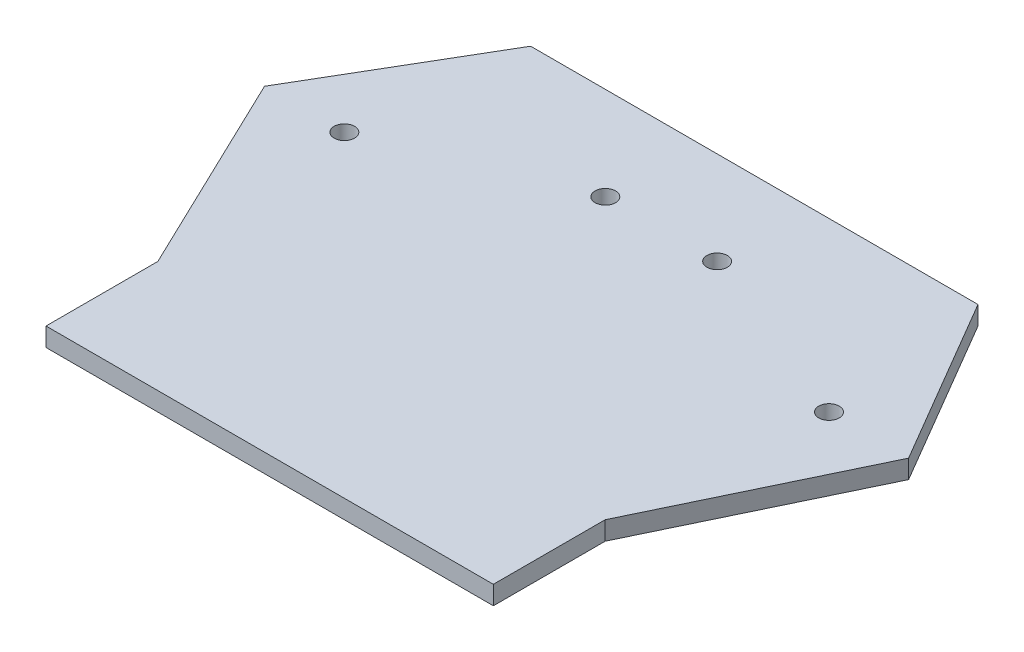
ISO-10303-21;
HEADER;
FILE_DESCRIPTION(('STEP AP214'),'2;1');
FILE_NAME('part.step','',(''),(''),'','','');
FILE_SCHEMA(('AUTOMOTIVE_DESIGN { 1 0 10303 214 1 1 1 1 }'));
ENDSEC;
DATA;
#1=APPLICATION_CONTEXT('core data for automotive mechanical design processes');
#2=APPLICATION_PROTOCOL_DEFINITION('international standard','automotive_design',2000,#1);
#3=PRODUCT_CONTEXT('',#1,'mechanical');
#4=PRODUCT('Part','Part','',(#3));
#5=PRODUCT_RELATED_PRODUCT_CATEGORY('part','',(#4));
#6=PRODUCT_DEFINITION_FORMATION('','',#4);
#7=PRODUCT_DEFINITION_CONTEXT('part definition',#1,'design');
#8=PRODUCT_DEFINITION('design','',#6,#7);
#9=PRODUCT_DEFINITION_SHAPE('','',#8);
#10=(LENGTH_UNIT() NAMED_UNIT(*) SI_UNIT(.MILLI.,.METRE.));
#11=(NAMED_UNIT(*) PLANE_ANGLE_UNIT() SI_UNIT($,.RADIAN.));
#12=(NAMED_UNIT(*) SI_UNIT($,.STERADIAN.) SOLID_ANGLE_UNIT());
#13=UNCERTAINTY_MEASURE_WITH_UNIT(LENGTH_MEASURE(1.E-05),#10,'distance_accuracy_value','');
#14=(GEOMETRIC_REPRESENTATION_CONTEXT(3) GLOBAL_UNCERTAINTY_ASSIGNED_CONTEXT((#13)) GLOBAL_UNIT_ASSIGNED_CONTEXT((#10,
#11,#12)) REPRESENTATION_CONTEXT('',''));
#15=CARTESIAN_POINT('',(0.,0.,0.));
#16=DIRECTION('',(0.,0.,1.));
#17=DIRECTION('',(1.,0.,0.));
#18=AXIS2_PLACEMENT_3D('',#15,#16,#17);
#19=CARTESIAN_POINT('',(-37.086877056062,5.,17.7911335719755));
#20=DIRECTION('',(0.901623256546711,0.,-0.432522257524515));
#21=DIRECTION('',(-0.432522257524515,0.,-0.901623256546711));
#22=AXIS2_PLACEMENT_3D('',#19,#20,#21);
#23=PLANE('',#22);
#24=DIRECTION('',(0.432522257524515,0.,0.901623256546711));
#25=VECTOR('',#24,1.);
#26=CARTESIAN_POINT('',(-37.086877056062,0.,17.7911335719755));
#27=LINE('',#26,#25);
#28=CARTESIAN_POINT('',(-86.3843284776848,0.,-84.972892826591));
#29=VERTEX_POINT('',#28);
#30=CARTESIAN_POINT('',(-60.,0.,-29.972892826591));
#31=VERTEX_POINT('',#30);
#32=EDGE_CURVE('E146',#29,#31,#27,.T.);
#33=ORIENTED_EDGE('',*,*,#32,.T.);
#34=DIRECTION('',(0.,-1.,0.));
#35=VECTOR('',#34,1.);
#36=CARTESIAN_POINT('',(-60.,5.,-29.972892826591));
#37=LINE('',#36,#35);
#38=CARTESIAN_POINT('',(-60.,5.,-29.972892826591));
#39=VERTEX_POINT('',#38);
#40=EDGE_CURVE('E11',#39,#31,#37,.T.);
#41=ORIENTED_EDGE('',*,*,#40,.F.);
#42=DIRECTION('',(0.432522257524515,0.,0.901623256546711));
#43=VECTOR('',#42,1.);
#44=CARTESIAN_POINT('',(-37.086877056062,5.,17.7911335719755));
#45=LINE('',#44,#43);
#46=CARTESIAN_POINT('',(-86.3843284776848,5.,-84.972892826591));
#47=VERTEX_POINT('',#46);
#48=EDGE_CURVE('E198',#47,#39,#45,.T.);
#49=ORIENTED_EDGE('',*,*,#48,.F.);
#50=DIRECTION('',(0.,-1.,0.));
#51=VECTOR('',#50,1.);
#52=CARTESIAN_POINT('',(-86.3843284776848,5.,-84.972892826591));
#53=LINE('',#52,#51);
#54=EDGE_CURVE('E52',#47,#29,#53,.T.);
#55=ORIENTED_EDGE('',*,*,#54,.T.);
#56=EDGE_LOOP('',(#33,#41,#49,#55));
#57=FACE_BOUND('',#56,.T.);
#58=ADVANCED_FACE('F35',(#57),#23,.F.);
#59=CARTESIAN_POINT('',(-60.,5.,0.));
#60=DIRECTION('',(1.,0.,0.));
#61=DIRECTION('',(0.,0.,-1.));
#62=AXIS2_PLACEMENT_3D('',#59,#60,#61);
#63=PLANE('',#62);
#64=DIRECTION('',(0.,0.,1.));
#65=VECTOR('',#64,1.);
#66=CARTESIAN_POINT('',(-60.,0.,0.));
#67=LINE('',#66,#65);
#68=CARTESIAN_POINT('',(-60.,0.,0.0271071734090356));
#69=VERTEX_POINT('',#68);
#70=EDGE_CURVE('E148',#31,#69,#67,.T.);
#71=ORIENTED_EDGE('',*,*,#70,.T.);
#72=DIRECTION('',(0.,-1.,0.));
#73=VECTOR('',#72,1.);
#74=CARTESIAN_POINT('',(-60.,5.,0.0271071734090356));
#75=LINE('',#74,#73);
#76=CARTESIAN_POINT('',(-60.,5.,0.0271071734090356));
#77=VERTEX_POINT('',#76);
#78=EDGE_CURVE('E44',#77,#69,#75,.T.);
#79=ORIENTED_EDGE('',*,*,#78,.F.);
#80=DIRECTION('',(0.,0.,1.));
#81=VECTOR('',#80,1.);
#82=CARTESIAN_POINT('',(-60.,5.,0.));
#83=LINE('',#82,#81);
#84=EDGE_CURVE('E91',#39,#77,#83,.T.);
#85=ORIENTED_EDGE('',*,*,#84,.F.);
#86=ORIENTED_EDGE('',*,*,#40,.T.);
#87=EDGE_LOOP('',(#71,#79,#85,#86));
#88=FACE_BOUND('',#87,.T.);
#89=ADVANCED_FACE('F227',(#88),#63,.F.);
#90=CARTESIAN_POINT('',(0.,5.,0.0271071734090356));
#91=DIRECTION('',(0.,0.,-1.));
#92=DIRECTION('',(-1.,0.,0.));
#93=AXIS2_PLACEMENT_3D('',#90,#91,#92);
#94=PLANE('',#93);
#95=DIRECTION('',(1.,0.,0.));
#96=VECTOR('',#95,1.);
#97=CARTESIAN_POINT('',(0.,0.,0.0271071734090356));
#98=LINE('',#97,#96);
#99=CARTESIAN_POINT('',(60.,0.,0.0271071734090356));
#100=VERTEX_POINT('',#99);
#101=EDGE_CURVE('E150',#69,#100,#98,.T.);
#102=ORIENTED_EDGE('',*,*,#101,.T.);
#103=DIRECTION('',(0.,-1.,0.));
#104=VECTOR('',#103,1.);
#105=CARTESIAN_POINT('',(60.,5.,0.0271071734090356));
#106=LINE('',#105,#104);
#107=CARTESIAN_POINT('',(60.,5.,0.0271071734090356));
#108=VERTEX_POINT('',#107);
#109=EDGE_CURVE('E177',#108,#100,#106,.T.);
#110=ORIENTED_EDGE('',*,*,#109,.F.);
#111=DIRECTION('',(1.,0.,0.));
#112=VECTOR('',#111,1.);
#113=CARTESIAN_POINT('',(0.,5.,0.0271071734090356));
#114=LINE('',#113,#112);
#115=EDGE_CURVE('E184',#77,#108,#114,.T.);
#116=ORIENTED_EDGE('',*,*,#115,.F.);
#117=ORIENTED_EDGE('',*,*,#78,.T.);
#118=EDGE_LOOP('',(#102,#110,#116,#117));
#119=FACE_BOUND('',#118,.T.);
#120=ADVANCED_FACE('F182',(#119),#94,.F.);
#121=CARTESIAN_POINT('',(60.,5.,0.));
#122=DIRECTION('',(1.,0.,0.));
#123=DIRECTION('',(0.,0.,-1.));
#124=AXIS2_PLACEMENT_3D('',#121,#122,#123);
#125=PLANE('',#124);
#126=DIRECTION('',(0.,0.,1.));
#127=VECTOR('',#126,1.);
#128=CARTESIAN_POINT('',(60.,0.,0.));
#129=LINE('',#128,#127);
#130=CARTESIAN_POINT('',(60.,0.,-29.972892826591));
#131=VERTEX_POINT('',#130);
#132=EDGE_CURVE('E153',#131,#100,#129,.T.);
#133=ORIENTED_EDGE('',*,*,#132,.F.);
#134=DIRECTION('',(0.,-1.,0.));
#135=VECTOR('',#134,1.);
#136=CARTESIAN_POINT('',(60.,5.,-29.972892826591));
#137=LINE('',#136,#135);
#138=CARTESIAN_POINT('',(60.,5.,-29.972892826591));
#139=VERTEX_POINT('',#138);
#140=EDGE_CURVE('E175',#139,#131,#137,.T.);
#141=ORIENTED_EDGE('',*,*,#140,.F.);
#142=DIRECTION('',(0.,0.,1.));
#143=VECTOR('',#142,1.);
#144=CARTESIAN_POINT('',(60.,5.,0.));
#145=LINE('',#144,#143);
#146=EDGE_CURVE('E193',#139,#108,#145,.T.);
#147=ORIENTED_EDGE('',*,*,#146,.T.);
#148=ORIENTED_EDGE('',*,*,#109,.T.);
#149=EDGE_LOOP('',(#133,#141,#147,#148));
#150=FACE_BOUND('',#149,.T.);
#151=ADVANCED_FACE('F191',(#150),#125,.T.);
#152=CARTESIAN_POINT('',(37.086877056062,5.,17.7911335719755));
#153=DIRECTION('',(0.901623256546711,0.,0.432522257524515));
#154=DIRECTION('',(0.432522257524515,0.,-0.901623256546711));
#155=AXIS2_PLACEMENT_3D('',#152,#153,#154);
#156=PLANE('',#155);
#157=DIRECTION('',(-0.432522257524515,0.,0.901623256546711));
#158=VECTOR('',#157,1.);
#159=CARTESIAN_POINT('',(37.086877056062,0.,17.7911335719755));
#160=LINE('',#159,#158);
#161=CARTESIAN_POINT('',(86.3843284776848,0.,-84.972892826591));
#162=VERTEX_POINT('',#161);
#163=EDGE_CURVE('E156',#162,#131,#160,.T.);
#164=ORIENTED_EDGE('',*,*,#163,.F.);
#165=DIRECTION('',(0.,-1.,0.));
#166=VECTOR('',#165,1.);
#167=CARTESIAN_POINT('',(86.3843284776848,5.,-84.972892826591));
#168=LINE('',#167,#166);
#169=CARTESIAN_POINT('',(86.3843284776848,5.,-84.972892826591));
#170=VERTEX_POINT('',#169);
#171=EDGE_CURVE('E126',#170,#162,#168,.T.);
#172=ORIENTED_EDGE('',*,*,#171,.F.);
#173=DIRECTION('',(-0.432522257524515,0.,0.901623256546711));
#174=VECTOR('',#173,1.);
#175=CARTESIAN_POINT('',(37.086877056062,5.,17.7911335719755));
#176=LINE('',#175,#174);
#177=EDGE_CURVE('E116',#170,#139,#176,.T.);
#178=ORIENTED_EDGE('',*,*,#177,.T.);
#179=ORIENTED_EDGE('',*,*,#140,.T.);
#180=EDGE_LOOP('',(#164,#172,#178,#179));
#181=FACE_BOUND('',#180,.T.);
#182=ADVANCED_FACE('F238',(#181),#156,.T.);
#183=CARTESIAN_POINT('',(101.360778305918,5.,-59.4296904350472));
#184=DIRECTION('',(-0.862655997436624,0.,0.505791093324728));
#185=DIRECTION('',(0.505791093324728,0.,0.862655997436624));
#186=AXIS2_PLACEMENT_3D('',#183,#184,#185);
#187=PLANE('',#186);
#188=DIRECTION('',(-0.505791093324728,0.,-0.862655997436624));
#189=VECTOR('',#188,1.);
#190=CARTESIAN_POINT('',(101.360778305918,0.,-59.4296904350472));
#191=LINE('',#190,#189);
#192=CARTESIAN_POINT('',(60.,0.,-129.972892826591));
#193=VERTEX_POINT('',#192);
#194=EDGE_CURVE('E123',#162,#193,#191,.T.);
#195=ORIENTED_EDGE('',*,*,#194,.T.);
#196=DIRECTION('',(0.,-1.,0.));
#197=VECTOR('',#196,1.);
#198=CARTESIAN_POINT('',(60.,5.,-129.972892826591));
#199=LINE('',#198,#197);
#200=CARTESIAN_POINT('',(60.,5.,-129.972892826591));
#201=VERTEX_POINT('',#200);
#202=EDGE_CURVE('E120',#201,#193,#199,.T.);
#203=ORIENTED_EDGE('',*,*,#202,.F.);
#204=DIRECTION('',(-0.505791093324728,0.,-0.862655997436624));
#205=VECTOR('',#204,1.);
#206=CARTESIAN_POINT('',(101.360778305918,5.,-59.4296904350472));
#207=LINE('',#206,#205);
#208=EDGE_CURVE('E107',#170,#201,#207,.T.);
#209=ORIENTED_EDGE('',*,*,#208,.F.);
#210=ORIENTED_EDGE('',*,*,#171,.T.);
#211=EDGE_LOOP('',(#195,#203,#209,#210));
#212=FACE_BOUND('',#211,.T.);
#213=ADVANCED_FACE('F121',(#212),#187,.F.);
#214=CARTESIAN_POINT('',(0.,5.,-129.972892826591));
#215=DIRECTION('',(0.,0.,1.));
#216=DIRECTION('',(1.,0.,0.));
#217=AXIS2_PLACEMENT_3D('',#214,#215,#216);
#218=PLANE('',#217);
#219=DIRECTION('',(-1.,0.,0.));
#220=VECTOR('',#219,1.);
#221=CARTESIAN_POINT('',(0.,0.,-129.972892826591));
#222=LINE('',#221,#220);
#223=CARTESIAN_POINT('',(-60.,0.,-129.972892826591));
#224=VERTEX_POINT('',#223);
#225=EDGE_CURVE('E160',#193,#224,#222,.T.);
#226=ORIENTED_EDGE('',*,*,#225,.T.);
#227=DIRECTION('',(0.,-1.,0.));
#228=VECTOR('',#227,1.);
#229=CARTESIAN_POINT('',(-60.,5.,-129.972892826591));
#230=LINE('',#229,#228);
#231=CARTESIAN_POINT('',(-60.,5.,-129.972892826591));
#232=VERTEX_POINT('',#231);
#233=EDGE_CURVE('E79',#232,#224,#230,.T.);
#234=ORIENTED_EDGE('',*,*,#233,.F.);
#235=DIRECTION('',(-1.,0.,0.));
#236=VECTOR('',#235,1.);
#237=CARTESIAN_POINT('',(0.,5.,-129.972892826591));
#238=LINE('',#237,#236);
#239=EDGE_CURVE('E113',#201,#232,#238,.T.);
#240=ORIENTED_EDGE('',*,*,#239,.F.);
#241=ORIENTED_EDGE('',*,*,#202,.T.);
#242=EDGE_LOOP('',(#226,#234,#240,#241));
#243=FACE_BOUND('',#242,.T.);
#244=ADVANCED_FACE('F128',(#243),#218,.F.);
#245=CARTESIAN_POINT('',(65.,5.,-85.));
#246=DIRECTION('',(0.,-1.,0.));
#247=DIRECTION('',(0.,0.,-1.));
#248=AXIS2_PLACEMENT_3D('',#245,#246,#247);
#249=CYLINDRICAL_SURFACE('',#248,2.75000000000001);
#250=CARTESIAN_POINT('',(65.,5.,-85.));
#251=DIRECTION('',(0.,1.,0.));
#252=DIRECTION('',(0.,0.,1.));
#253=AXIS2_PLACEMENT_3D('',#250,#251,#252);
#254=CIRCLE('',#253,2.75000000000001);
#255=CARTESIAN_POINT('',(65.,5.,-82.25));
#256=VERTEX_POINT('',#255);
#257=EDGE_CURVE('E131',#256,#256,#254,.F.);
#258=ORIENTED_EDGE('',*,*,#257,.F.);
#259=EDGE_LOOP('',(#258));
#260=FACE_BOUND('',#259,.T.);
#261=CARTESIAN_POINT('',(65.,0.,-85.));
#262=DIRECTION('',(0.,1.,0.));
#263=DIRECTION('',(0.,0.,1.));
#264=AXIS2_PLACEMENT_3D('',#261,#262,#263);
#265=CIRCLE('',#264,2.75000000000001);
#266=CARTESIAN_POINT('',(65.,0.,-82.25));
#267=VERTEX_POINT('',#266);
#268=EDGE_CURVE('E165',#267,#267,#265,.F.);
#269=ORIENTED_EDGE('',*,*,#268,.T.);
#270=EDGE_LOOP('',(#269));
#271=FACE_BOUND('',#270,.T.);
#272=ADVANCED_FACE('F246',(#260,#271),#249,.F.);
#273=CARTESIAN_POINT('',(-101.360778305918,5.,-59.4296904350472));
#274=DIRECTION('',(-0.862655997436624,0.,-0.505791093324728));
#275=DIRECTION('',(-0.505791093324728,0.,0.862655997436624));
#276=AXIS2_PLACEMENT_3D('',#273,#274,#275);
#277=PLANE('',#276);
#278=DIRECTION('',(0.505791093324728,0.,-0.862655997436624));
#279=VECTOR('',#278,1.);
#280=CARTESIAN_POINT('',(-101.360778305918,0.,-59.4296904350472));
#281=LINE('',#280,#279);
#282=EDGE_CURVE('E162',#29,#224,#281,.T.);
#283=ORIENTED_EDGE('',*,*,#282,.F.);
#284=ORIENTED_EDGE('',*,*,#54,.F.);
#285=DIRECTION('',(0.505791093324728,0.,-0.862655997436624));
#286=VECTOR('',#285,1.);
#287=CARTESIAN_POINT('',(-101.360778305918,5.,-59.4296904350472));
#288=LINE('',#287,#286);
#289=EDGE_CURVE('E129',#47,#232,#288,.T.);
#290=ORIENTED_EDGE('',*,*,#289,.T.);
#291=ORIENTED_EDGE('',*,*,#233,.T.);
#292=EDGE_LOOP('',(#283,#284,#290,#291));
#293=FACE_BOUND('',#292,.T.);
#294=ADVANCED_FACE('F217',(#293),#277,.T.);
#295=CARTESIAN_POINT('',(-65.,5.,-85.));
#296=DIRECTION('',(0.,-1.,0.));
#297=DIRECTION('',(0.,0.,-1.));
#298=AXIS2_PLACEMENT_3D('',#295,#296,#297);
#299=CYLINDRICAL_SURFACE('',#298,2.75);
#300=CARTESIAN_POINT('',(-65.,5.,-85.));
#301=DIRECTION('',(0.,1.,0.));
#302=DIRECTION('',(0.,0.,1.));
#303=AXIS2_PLACEMENT_3D('',#300,#301,#302);
#304=CIRCLE('',#303,2.75);
#305=CARTESIAN_POINT('',(-65.,5.,-82.25));
#306=VERTEX_POINT('',#305);
#307=EDGE_CURVE('E200',#306,#306,#304,.T.);
#308=ORIENTED_EDGE('',*,*,#307,.T.);
#309=EDGE_LOOP('',(#308));
#310=FACE_BOUND('',#309,.T.);
#311=CARTESIAN_POINT('',(-65.,0.,-85.));
#312=DIRECTION('',(0.,1.,0.));
#313=DIRECTION('',(0.,0.,1.));
#314=AXIS2_PLACEMENT_3D('',#311,#312,#313);
#315=CIRCLE('',#314,2.75);
#316=CARTESIAN_POINT('',(-65.,0.,-82.25));
#317=VERTEX_POINT('',#316);
#318=EDGE_CURVE('E143',#317,#317,#315,.T.);
#319=ORIENTED_EDGE('',*,*,#318,.F.);
#320=EDGE_LOOP('',(#319));
#321=FACE_BOUND('',#320,.T.);
#322=ADVANCED_FACE('F214',(#310,#321),#299,.F.);
#323=CARTESIAN_POINT('',(-15.,5.,-105.));
#324=DIRECTION('',(0.,-1.,0.));
#325=DIRECTION('',(0.,0.,-1.));
#326=AXIS2_PLACEMENT_3D('',#323,#324,#325);
#327=CYLINDRICAL_SURFACE('',#326,2.75);
#328=CARTESIAN_POINT('',(-15.,5.,-105.));
#329=DIRECTION('',(0.,1.,0.));
#330=DIRECTION('',(0.,0.,1.));
#331=AXIS2_PLACEMENT_3D('',#328,#329,#330);
#332=CIRCLE('',#331,2.75);
#333=CARTESIAN_POINT('',(-15.,5.,-102.25));
#334=VERTEX_POINT('',#333);
#335=EDGE_CURVE('E171',#334,#334,#332,.T.);
#336=ORIENTED_EDGE('',*,*,#335,.T.);
#337=EDGE_LOOP('',(#336));
#338=FACE_BOUND('',#337,.T.);
#339=CARTESIAN_POINT('',(-15.,0.,-105.));
#340=DIRECTION('',(0.,1.,0.));
#341=DIRECTION('',(0.,0.,1.));
#342=AXIS2_PLACEMENT_3D('',#339,#340,#341);
#343=CIRCLE('',#342,2.75);
#344=CARTESIAN_POINT('',(-15.,0.,-102.25));
#345=VERTEX_POINT('',#344);
#346=EDGE_CURVE('E140',#345,#345,#343,.T.);
#347=ORIENTED_EDGE('',*,*,#346,.F.);
#348=EDGE_LOOP('',(#347));
#349=FACE_BOUND('',#348,.T.);
#350=ADVANCED_FACE('F37',(#338,#349),#327,.F.);
#351=CARTESIAN_POINT('',(15.,5.,-105.));
#352=DIRECTION('',(0.,-1.,0.));
#353=DIRECTION('',(0.,0.,-1.));
#354=AXIS2_PLACEMENT_3D('',#351,#352,#353);
#355=CYLINDRICAL_SURFACE('',#354,2.75);
#356=CARTESIAN_POINT('',(15.,5.,-105.));
#357=DIRECTION('',(0.,1.,0.));
#358=DIRECTION('',(0.,0.,1.));
#359=AXIS2_PLACEMENT_3D('',#356,#357,#358);
#360=CIRCLE('',#359,2.75);
#361=CARTESIAN_POINT('',(15.,5.,-102.25));
#362=VERTEX_POINT('',#361);
#363=EDGE_CURVE('E137',#362,#362,#360,.F.);
#364=ORIENTED_EDGE('',*,*,#363,.F.);
#365=EDGE_LOOP('',(#364));
#366=FACE_BOUND('',#365,.T.);
#367=CARTESIAN_POINT('',(15.,0.,-105.));
#368=DIRECTION('',(0.,1.,0.));
#369=DIRECTION('',(0.,0.,1.));
#370=AXIS2_PLACEMENT_3D('',#367,#368,#369);
#371=CIRCLE('',#370,2.75);
#372=CARTESIAN_POINT('',(15.,0.,-102.25));
#373=VERTEX_POINT('',#372);
#374=EDGE_CURVE('E168',#373,#373,#371,.F.);
#375=ORIENTED_EDGE('',*,*,#374,.T.);
#376=EDGE_LOOP('',(#375));
#377=FACE_BOUND('',#376,.T.);
#378=ADVANCED_FACE('F210',(#366,#377),#355,.F.);
#379=CARTESIAN_POINT('',(0.,5.,0.));
#380=DIRECTION('',(0.,1.,0.));
#381=DIRECTION('',(0.,0.,1.));
#382=AXIS2_PLACEMENT_3D('',#379,#380,#381);
#383=PLANE('',#382);
#384=ORIENTED_EDGE('',*,*,#335,.F.);
#385=EDGE_LOOP('',(#384));
#386=FACE_BOUND('',#385,.T.);
#387=ORIENTED_EDGE('',*,*,#307,.F.);
#388=EDGE_LOOP('',(#387));
#389=FACE_BOUND('',#388,.T.);
#390=ORIENTED_EDGE('',*,*,#48,.T.);
#391=ORIENTED_EDGE('',*,*,#84,.T.);
#392=ORIENTED_EDGE('',*,*,#115,.T.);
#393=ORIENTED_EDGE('',*,*,#146,.F.);
#394=ORIENTED_EDGE('',*,*,#177,.F.);
#395=ORIENTED_EDGE('',*,*,#208,.T.);
#396=ORIENTED_EDGE('',*,*,#239,.T.);
#397=ORIENTED_EDGE('',*,*,#289,.F.);
#398=EDGE_LOOP('',(#390,#391,#392,#393,#394,#395,#396,#397));
#399=FACE_BOUND('',#398,.T.);
#400=ORIENTED_EDGE('',*,*,#257,.T.);
#401=EDGE_LOOP('',(#400));
#402=FACE_BOUND('',#401,.T.);
#403=ORIENTED_EDGE('',*,*,#363,.T.);
#404=EDGE_LOOP('',(#403));
#405=FACE_BOUND('',#404,.T.);
#406=ADVANCED_FACE('F109',(#386,#389,#399,#402,#405),#383,.T.);
#407=CARTESIAN_POINT('',(0.,0.,0.));
#408=DIRECTION('',(0.,1.,0.));
#409=DIRECTION('',(0.,0.,1.));
#410=AXIS2_PLACEMENT_3D('',#407,#408,#409);
#411=PLANE('',#410);
#412=ORIENTED_EDGE('',*,*,#346,.T.);
#413=EDGE_LOOP('',(#412));
#414=FACE_BOUND('',#413,.T.);
#415=ORIENTED_EDGE('',*,*,#318,.T.);
#416=EDGE_LOOP('',(#415));
#417=FACE_BOUND('',#416,.T.);
#418=ORIENTED_EDGE('',*,*,#32,.F.);
#419=ORIENTED_EDGE('',*,*,#282,.T.);
#420=ORIENTED_EDGE('',*,*,#225,.F.);
#421=ORIENTED_EDGE('',*,*,#194,.F.);
#422=ORIENTED_EDGE('',*,*,#163,.T.);
#423=ORIENTED_EDGE('',*,*,#132,.T.);
#424=ORIENTED_EDGE('',*,*,#101,.F.);
#425=ORIENTED_EDGE('',*,*,#70,.F.);
#426=EDGE_LOOP('',(#418,#419,#420,#421,#422,#423,#424,#425));
#427=FACE_BOUND('',#426,.T.);
#428=ORIENTED_EDGE('',*,*,#268,.F.);
#429=EDGE_LOOP('',(#428));
#430=FACE_BOUND('',#429,.T.);
#431=ORIENTED_EDGE('',*,*,#374,.F.);
#432=EDGE_LOOP('',(#431));
#433=FACE_BOUND('',#432,.T.);
#434=ADVANCED_FACE('F186',(#414,#417,#427,#430,#433),#411,.F.);
#435=CLOSED_SHELL('',(#58,#89,#120,#151,#182,#213,#244,#272,#294,#322,#350,#378,#406,#434));
#436=MANIFOLD_SOLID_BREP('B2',#435);
#437=ADVANCED_BREP_SHAPE_REPRESENTATION('',(#18,#436),#14);
#438=SHAPE_DEFINITION_REPRESENTATION(#9,#437);
ENDSEC;
END-ISO-10303-21;
